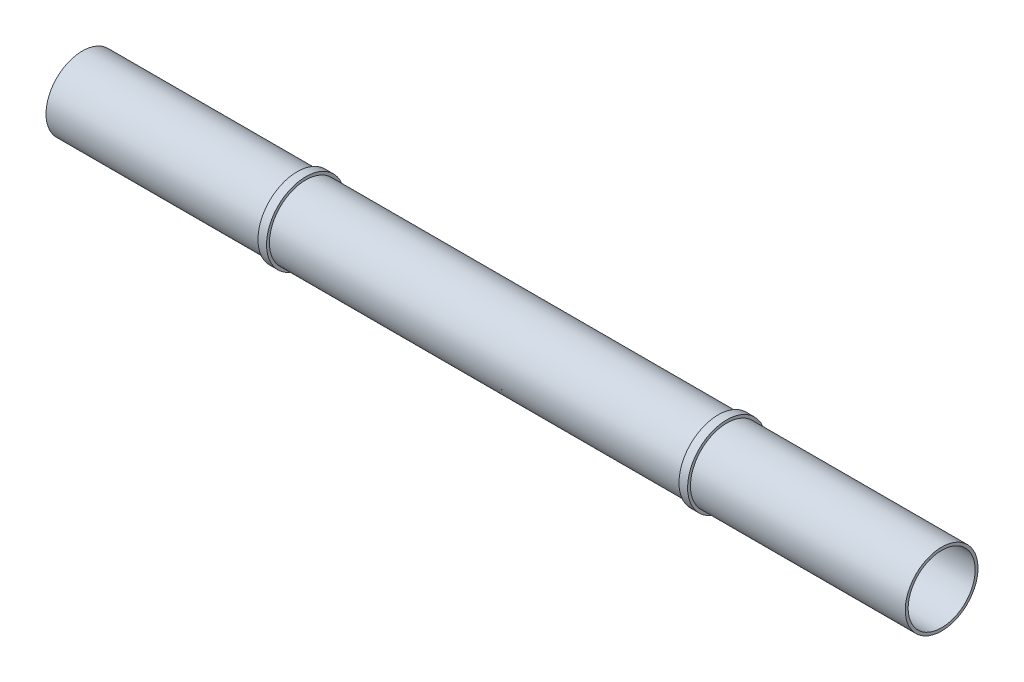
ISO-10303-21;
HEADER;
FILE_DESCRIPTION(('STEP AP214'),'2;1');
FILE_NAME('part.step','',(''),(''),'','','');
FILE_SCHEMA(('AUTOMOTIVE_DESIGN { 1 0 10303 214 1 1 1 1 }'));
ENDSEC;
DATA;
#1=APPLICATION_CONTEXT('core data for automotive mechanical design processes');
#2=APPLICATION_PROTOCOL_DEFINITION('international standard','automotive_design',2000,#1);
#3=PRODUCT_CONTEXT('',#1,'mechanical');
#4=PRODUCT('Part','Part','',(#3));
#5=PRODUCT_RELATED_PRODUCT_CATEGORY('part','',(#4));
#6=PRODUCT_DEFINITION_FORMATION('','',#4);
#7=PRODUCT_DEFINITION_CONTEXT('part definition',#1,'design');
#8=PRODUCT_DEFINITION('design','',#6,#7);
#9=PRODUCT_DEFINITION_SHAPE('','',#8);
#10=(LENGTH_UNIT() NAMED_UNIT(*) SI_UNIT(.MILLI.,.METRE.));
#11=(NAMED_UNIT(*) PLANE_ANGLE_UNIT() SI_UNIT($,.RADIAN.));
#12=(NAMED_UNIT(*) SI_UNIT($,.STERADIAN.) SOLID_ANGLE_UNIT());
#13=UNCERTAINTY_MEASURE_WITH_UNIT(LENGTH_MEASURE(1.E-05),#10,'distance_accuracy_value','');
#14=(GEOMETRIC_REPRESENTATION_CONTEXT(3) GLOBAL_UNCERTAINTY_ASSIGNED_CONTEXT((#13)) GLOBAL_UNIT_ASSIGNED_CONTEXT((#10,
#11,#12)) REPRESENTATION_CONTEXT('',''));
#15=CARTESIAN_POINT('',(0.,0.,0.));
#16=DIRECTION('',(0.,0.,1.));
#17=DIRECTION('',(1.,0.,0.));
#18=AXIS2_PLACEMENT_3D('',#15,#16,#17);
#19=CARTESIAN_POINT('',(150.,0.,0.));
#20=DIRECTION('',(-1.,0.,0.));
#21=DIRECTION('',(0.,-1.,0.));
#22=AXIS2_PLACEMENT_3D('',#19,#20,#21);
#23=PLANE('',#22);
#24=CARTESIAN_POINT('',(150.,0.,0.));
#25=DIRECTION('',(-1.,0.,0.));
#26=DIRECTION('',(0.,-1.,0.));
#27=AXIS2_PLACEMENT_3D('',#24,#25,#26);
#28=CIRCLE('',#27,11.7);
#29=CARTESIAN_POINT('',(150.,-11.7,0.));
#30=VERTEX_POINT('',#29);
#31=EDGE_CURVE('E86',#30,#30,#28,.T.);
#32=ORIENTED_EDGE('',*,*,#31,.T.);
#33=EDGE_LOOP('',(#32));
#34=FACE_BOUND('',#33,.T.);
#35=CARTESIAN_POINT('',(150.,0.,0.));
#36=DIRECTION('',(-1.,0.,0.));
#37=DIRECTION('',(0.,-1.,0.));
#38=AXIS2_PLACEMENT_3D('',#35,#36,#37);
#39=CIRCLE('',#38,12.7);
#40=CARTESIAN_POINT('',(150.,-12.7,0.));
#41=VERTEX_POINT('',#40);
#42=EDGE_CURVE('E10',#41,#41,#39,.T.);
#43=ORIENTED_EDGE('',*,*,#42,.F.);
#44=EDGE_LOOP('',(#43));
#45=FACE_BOUND('',#44,.T.);
#46=ADVANCED_FACE('F39',(#34,#45),#23,.F.);
#47=CARTESIAN_POINT('',(-150.,0.,0.));
#48=DIRECTION('',(-1.,0.,0.));
#49=DIRECTION('',(0.,-1.,0.));
#50=AXIS2_PLACEMENT_3D('',#47,#48,#49);
#51=CYLINDRICAL_SURFACE('',#50,12.7);
#52=CARTESIAN_POINT('',(75.,0.,0.));
#53=DIRECTION('',(-1.,0.,0.));
#54=DIRECTION('',(0.,-1.,0.));
#55=AXIS2_PLACEMENT_3D('',#52,#53,#54);
#56=CIRCLE('',#55,12.7);
#57=CARTESIAN_POINT('',(75.,-12.7,0.));
#58=VERTEX_POINT('',#57);
#59=EDGE_CURVE('E46',#58,#58,#56,.T.);
#60=ORIENTED_EDGE('',*,*,#59,.F.);
#61=EDGE_LOOP('',(#60));
#62=FACE_BOUND('',#61,.T.);
#63=ORIENTED_EDGE('',*,*,#42,.T.);
#64=EDGE_LOOP('',(#63));
#65=FACE_BOUND('',#64,.T.);
#66=ADVANCED_FACE('F106',(#62,#65),#51,.T.);
#67=CARTESIAN_POINT('',(75.,12.7,0.));
#68=DIRECTION('',(-1.,0.,0.));
#69=DIRECTION('',(0.,-1.,0.));
#70=AXIS2_PLACEMENT_3D('',#67,#68,#69);
#71=PLANE('',#70);
#72=CARTESIAN_POINT('',(75.,0.,0.));
#73=DIRECTION('',(-1.,0.,0.));
#74=DIRECTION('',(0.,-1.,0.));
#75=AXIS2_PLACEMENT_3D('',#72,#73,#74);
#76=CIRCLE('',#75,13.7);
#77=CARTESIAN_POINT('',(75.,-13.7,0.));
#78=VERTEX_POINT('',#77);
#79=EDGE_CURVE('E51',#78,#78,#76,.T.);
#80=ORIENTED_EDGE('',*,*,#79,.F.);
#81=EDGE_LOOP('',(#80));
#82=FACE_BOUND('',#81,.T.);
#83=ORIENTED_EDGE('',*,*,#59,.T.);
#84=EDGE_LOOP('',(#83));
#85=FACE_BOUND('',#84,.T.);
#86=ADVANCED_FACE('F110',(#82,#85),#71,.F.);
#87=CARTESIAN_POINT('',(-150.,0.,0.));
#88=DIRECTION('',(-1.,0.,0.));
#89=DIRECTION('',(0.,-1.,0.));
#90=AXIS2_PLACEMENT_3D('',#87,#88,#89);
#91=CYLINDRICAL_SURFACE('',#90,13.7);
#92=CARTESIAN_POINT('',(72.,0.,0.));
#93=DIRECTION('',(-1.,0.,0.));
#94=DIRECTION('',(0.,-1.,0.));
#95=AXIS2_PLACEMENT_3D('',#92,#93,#94);
#96=CIRCLE('',#95,13.7);
#97=CARTESIAN_POINT('',(72.,-13.7,0.));
#98=VERTEX_POINT('',#97);
#99=EDGE_CURVE('E56',#98,#98,#96,.T.);
#100=ORIENTED_EDGE('',*,*,#99,.F.);
#101=EDGE_LOOP('',(#100));
#102=FACE_BOUND('',#101,.T.);
#103=ORIENTED_EDGE('',*,*,#79,.T.);
#104=EDGE_LOOP('',(#103));
#105=FACE_BOUND('',#104,.T.);
#106=ADVANCED_FACE('F115',(#102,#105),#91,.T.);
#107=CARTESIAN_POINT('',(72.,13.7,0.));
#108=DIRECTION('',(1.,0.,0.));
#109=DIRECTION('',(0.,1.,0.));
#110=AXIS2_PLACEMENT_3D('',#107,#108,#109);
#111=PLANE('',#110);
#112=CARTESIAN_POINT('',(72.,0.,0.));
#113=DIRECTION('',(-1.,0.,0.));
#114=DIRECTION('',(0.,-1.,0.));
#115=AXIS2_PLACEMENT_3D('',#112,#113,#114);
#116=CIRCLE('',#115,12.7);
#117=CARTESIAN_POINT('',(72.,-12.7,0.));
#118=VERTEX_POINT('',#117);
#119=EDGE_CURVE('E62',#118,#118,#116,.T.);
#120=ORIENTED_EDGE('',*,*,#119,.F.);
#121=EDGE_LOOP('',(#120));
#122=FACE_BOUND('',#121,.T.);
#123=ORIENTED_EDGE('',*,*,#99,.T.);
#124=EDGE_LOOP('',(#123));
#125=FACE_BOUND('',#124,.T.);
#126=ADVANCED_FACE('F121',(#122,#125),#111,.F.);
#127=CARTESIAN_POINT('',(-150.,0.,0.));
#128=DIRECTION('',(-1.,0.,0.));
#129=DIRECTION('',(0.,-1.,0.));
#130=AXIS2_PLACEMENT_3D('',#127,#128,#129);
#131=CYLINDRICAL_SURFACE('',#130,12.7);
#132=CARTESIAN_POINT('',(-72.,0.,0.));
#133=DIRECTION('',(-1.,0.,0.));
#134=DIRECTION('',(0.,-1.,0.));
#135=AXIS2_PLACEMENT_3D('',#132,#133,#134);
#136=CIRCLE('',#135,12.7);
#137=CARTESIAN_POINT('',(-72.,-12.7,0.));
#138=VERTEX_POINT('',#137);
#139=EDGE_CURVE('E66',#138,#138,#136,.T.);
#140=ORIENTED_EDGE('',*,*,#139,.F.);
#141=EDGE_LOOP('',(#140));
#142=FACE_BOUND('',#141,.T.);
#143=ORIENTED_EDGE('',*,*,#119,.T.);
#144=EDGE_LOOP('',(#143));
#145=FACE_BOUND('',#144,.T.);
#146=ADVANCED_FACE('F125',(#142,#145),#131,.T.);
#147=CARTESIAN_POINT('',(-72.,13.7,0.));
#148=DIRECTION('',(-1.,0.,0.));
#149=DIRECTION('',(0.,-1.,0.));
#150=AXIS2_PLACEMENT_3D('',#147,#148,#149);
#151=PLANE('',#150);
#152=CARTESIAN_POINT('',(-72.,0.,0.));
#153=DIRECTION('',(-1.,0.,0.));
#154=DIRECTION('',(0.,-1.,0.));
#155=AXIS2_PLACEMENT_3D('',#152,#153,#154);
#156=CIRCLE('',#155,13.7);
#157=CARTESIAN_POINT('',(-72.,-13.7,0.));
#158=VERTEX_POINT('',#157);
#159=EDGE_CURVE('E70',#158,#158,#156,.T.);
#160=ORIENTED_EDGE('',*,*,#159,.F.);
#161=EDGE_LOOP('',(#160));
#162=FACE_BOUND('',#161,.T.);
#163=ORIENTED_EDGE('',*,*,#139,.T.);
#164=EDGE_LOOP('',(#163));
#165=FACE_BOUND('',#164,.T.);
#166=ADVANCED_FACE('F129',(#162,#165),#151,.F.);
#167=CARTESIAN_POINT('',(-150.,0.,0.));
#168=DIRECTION('',(-1.,0.,0.));
#169=DIRECTION('',(0.,-1.,0.));
#170=AXIS2_PLACEMENT_3D('',#167,#168,#169);
#171=CYLINDRICAL_SURFACE('',#170,13.7);
#172=CARTESIAN_POINT('',(-75.,0.,0.));
#173=DIRECTION('',(-1.,0.,0.));
#174=DIRECTION('',(0.,-1.,0.));
#175=AXIS2_PLACEMENT_3D('',#172,#173,#174);
#176=CIRCLE('',#175,13.7);
#177=CARTESIAN_POINT('',(-75.,-13.7,0.));
#178=VERTEX_POINT('',#177);
#179=EDGE_CURVE('E74',#178,#178,#176,.T.);
#180=ORIENTED_EDGE('',*,*,#179,.F.);
#181=EDGE_LOOP('',(#180));
#182=FACE_BOUND('',#181,.T.);
#183=ORIENTED_EDGE('',*,*,#159,.T.);
#184=EDGE_LOOP('',(#183));
#185=FACE_BOUND('',#184,.T.);
#186=ADVANCED_FACE('F133',(#182,#185),#171,.T.);
#187=CARTESIAN_POINT('',(-75.,12.7,0.));
#188=DIRECTION('',(1.,0.,0.));
#189=DIRECTION('',(0.,1.,0.));
#190=AXIS2_PLACEMENT_3D('',#187,#188,#189);
#191=PLANE('',#190);
#192=CARTESIAN_POINT('',(-75.,0.,0.));
#193=DIRECTION('',(-1.,0.,0.));
#194=DIRECTION('',(0.,-1.,0.));
#195=AXIS2_PLACEMENT_3D('',#192,#193,#194);
#196=CIRCLE('',#195,12.7);
#197=CARTESIAN_POINT('',(-75.,-12.7,0.));
#198=VERTEX_POINT('',#197);
#199=EDGE_CURVE('E78',#198,#198,#196,.T.);
#200=ORIENTED_EDGE('',*,*,#199,.F.);
#201=EDGE_LOOP('',(#200));
#202=FACE_BOUND('',#201,.T.);
#203=ORIENTED_EDGE('',*,*,#179,.T.);
#204=EDGE_LOOP('',(#203));
#205=FACE_BOUND('',#204,.T.);
#206=ADVANCED_FACE('F137',(#202,#205),#191,.F.);
#207=CARTESIAN_POINT('',(-150.,0.,0.));
#208=DIRECTION('',(-1.,0.,0.));
#209=DIRECTION('',(0.,-1.,0.));
#210=AXIS2_PLACEMENT_3D('',#207,#208,#209);
#211=CYLINDRICAL_SURFACE('',#210,12.7);
#212=CARTESIAN_POINT('',(-150.,0.,0.));
#213=DIRECTION('',(-1.,0.,0.));
#214=DIRECTION('',(0.,-1.,0.));
#215=AXIS2_PLACEMENT_3D('',#212,#213,#214);
#216=CIRCLE('',#215,12.7);
#217=CARTESIAN_POINT('',(-150.,-12.7,0.));
#218=VERTEX_POINT('',#217);
#219=EDGE_CURVE('E82',#218,#218,#216,.T.);
#220=ORIENTED_EDGE('',*,*,#219,.F.);
#221=EDGE_LOOP('',(#220));
#222=FACE_BOUND('',#221,.T.);
#223=ORIENTED_EDGE('',*,*,#199,.T.);
#224=EDGE_LOOP('',(#223));
#225=FACE_BOUND('',#224,.T.);
#226=ADVANCED_FACE('F141',(#222,#225),#211,.T.);
#227=CARTESIAN_POINT('',(-150.,0.,0.));
#228=DIRECTION('',(1.,0.,0.));
#229=DIRECTION('',(0.,1.,0.));
#230=AXIS2_PLACEMENT_3D('',#227,#228,#229);
#231=PLANE('',#230);
#232=CARTESIAN_POINT('',(-150.,0.,0.));
#233=DIRECTION('',(1.,0.,0.));
#234=DIRECTION('',(0.,1.,0.));
#235=AXIS2_PLACEMENT_3D('',#232,#233,#234);
#236=CIRCLE('',#235,11.7);
#237=CARTESIAN_POINT('',(-150.,11.7,0.));
#238=VERTEX_POINT('',#237);
#239=EDGE_CURVE('E90',#238,#238,#236,.T.);
#240=ORIENTED_EDGE('',*,*,#239,.T.);
#241=EDGE_LOOP('',(#240));
#242=FACE_BOUND('',#241,.T.);
#243=ORIENTED_EDGE('',*,*,#219,.T.);
#244=EDGE_LOOP('',(#243));
#245=FACE_BOUND('',#244,.T.);
#246=ADVANCED_FACE('F95',(#242,#245),#231,.F.);
#247=CARTESIAN_POINT('',(-150.,0.,0.));
#248=DIRECTION('',(1.,0.,0.));
#249=DIRECTION('',(0.,1.,0.));
#250=AXIS2_PLACEMENT_3D('',#247,#248,#249);
#251=CYLINDRICAL_SURFACE('',#250,11.7);
#252=ORIENTED_EDGE('',*,*,#239,.F.);
#253=EDGE_LOOP('',(#252));
#254=FACE_BOUND('',#253,.T.);
#255=ORIENTED_EDGE('',*,*,#31,.F.);
#256=EDGE_LOOP('',(#255));
#257=FACE_BOUND('',#256,.T.);
#258=ADVANCED_FACE('F98',(#254,#257),#251,.F.);
#259=CLOSED_SHELL('',(#46,#66,#86,#106,#126,#146,#166,#186,#206,#226,#246,#258));
#260=MANIFOLD_SOLID_BREP('B2',#259);
#261=ADVANCED_BREP_SHAPE_REPRESENTATION('',(#18,#260),#14);
#262=SHAPE_DEFINITION_REPRESENTATION(#9,#261);
ENDSEC;
END-ISO-10303-21;
